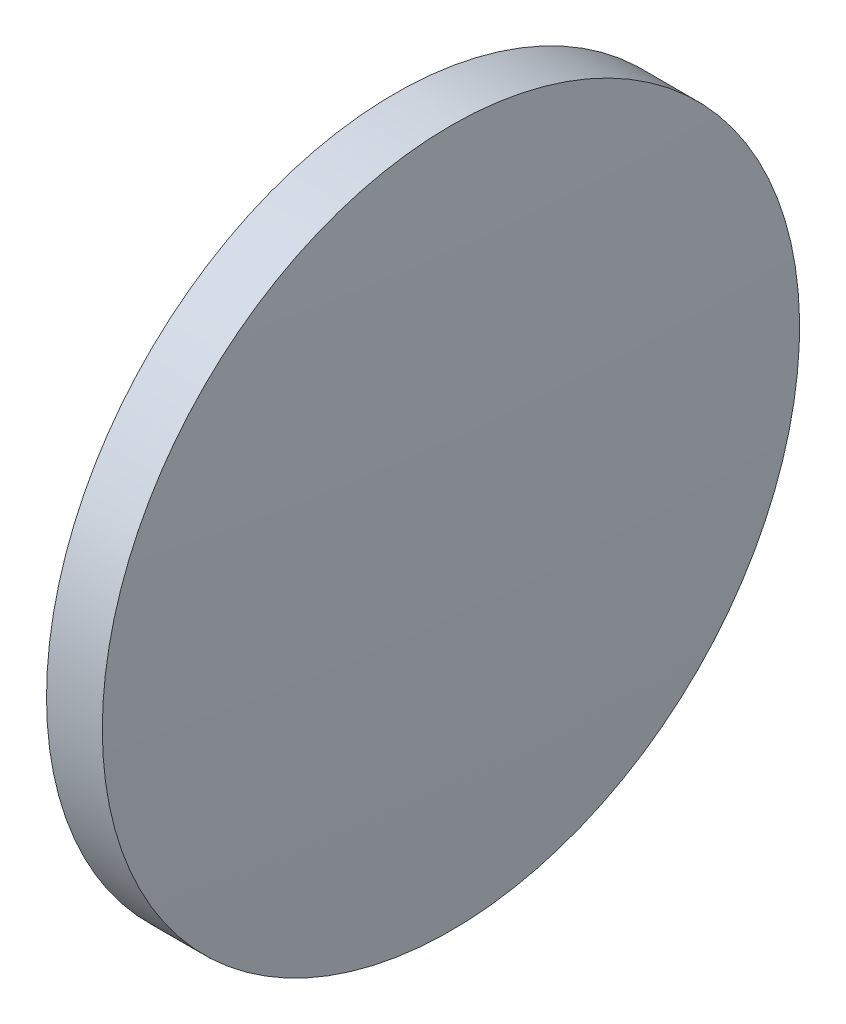
ISO-10303-21;
HEADER;
FILE_DESCRIPTION(('STEP AP214'),'2;1');
FILE_NAME('part.step','',(''),(''),'','','');
FILE_SCHEMA(('AUTOMOTIVE_DESIGN { 1 0 10303 214 1 1 1 1 }'));
ENDSEC;
DATA;
#1=APPLICATION_CONTEXT('core data for automotive mechanical design processes');
#2=APPLICATION_PROTOCOL_DEFINITION('international standard','automotive_design',2000,#1);
#3=PRODUCT_CONTEXT('',#1,'mechanical');
#4=PRODUCT('Part','Part','',(#3));
#5=PRODUCT_RELATED_PRODUCT_CATEGORY('part','',(#4));
#6=PRODUCT_DEFINITION_FORMATION('','',#4);
#7=PRODUCT_DEFINITION_CONTEXT('part definition',#1,'design');
#8=PRODUCT_DEFINITION('design','',#6,#7);
#9=PRODUCT_DEFINITION_SHAPE('','',#8);
#10=(LENGTH_UNIT() NAMED_UNIT(*) SI_UNIT(.MILLI.,.METRE.));
#11=(NAMED_UNIT(*) PLANE_ANGLE_UNIT() SI_UNIT($,.RADIAN.));
#12=(NAMED_UNIT(*) SI_UNIT($,.STERADIAN.) SOLID_ANGLE_UNIT());
#13=UNCERTAINTY_MEASURE_WITH_UNIT(LENGTH_MEASURE(1.E-05),#10,'distance_accuracy_value','');
#14=(GEOMETRIC_REPRESENTATION_CONTEXT(3) GLOBAL_UNCERTAINTY_ASSIGNED_CONTEXT((#13)) GLOBAL_UNIT_ASSIGNED_CONTEXT((#10,
#11,#12)) REPRESENTATION_CONTEXT('',''));
#15=CARTESIAN_POINT('',(0.,0.,0.));
#16=DIRECTION('',(0.,0.,1.));
#17=DIRECTION('',(1.,0.,0.));
#18=AXIS2_PLACEMENT_3D('',#15,#16,#17);
#19=CARTESIAN_POINT('',(490.791781865808,53.9419902168556,0.));
#20=DIRECTION('',(-1.,0.,0.));
#21=DIRECTION('',(0.,1.,0.));
#22=AXIS2_PLACEMENT_3D('',#19,#20,#21);
#23=SPHERICAL_SURFACE('',#22,205.782105263158);
#24=CARTESIAN_POINT('',(696.193887128966,53.9419902168559,0.));
#25=DIRECTION('',(-1.,0.,0.));
#26=DIRECTION('',(0.,0.,1.));
#27=AXIS2_PLACEMENT_3D('',#24,#25,#26);
#28=CIRCLE('',#27,12.5);
#29=CARTESIAN_POINT('',(696.193887128966,53.9419902168559,12.5));
#30=VERTEX_POINT('',#29);
#31=EDGE_CURVE('E10',#30,#30,#28,.T.);
#32=ORIENTED_EDGE('',*,*,#31,.F.);
#33=EDGE_LOOP('',(#32));
#34=FACE_BOUND('',#33,.T.);
#35=ADVANCED_FACE('F35',(#34),#23,.T.);
#36=CARTESIAN_POINT('',(692.164779550529,53.9419902168559,0.));
#37=DIRECTION('',(-1.,0.,0.));
#38=DIRECTION('',(0.,0.,1.));
#39=AXIS2_PLACEMENT_3D('',#36,#37,#38);
#40=CYLINDRICAL_SURFACE('',#39,12.5);
#41=CARTESIAN_POINT('',(694.193887128966,53.9419902168559,0.));
#42=DIRECTION('',(-1.,0.,0.));
#43=DIRECTION('',(0.,0.,1.));
#44=AXIS2_PLACEMENT_3D('',#41,#42,#43);
#45=CIRCLE('',#44,12.5);
#46=CARTESIAN_POINT('',(694.193887128966,53.9419902168559,12.5));
#47=VERTEX_POINT('',#46);
#48=EDGE_CURVE('E41',#47,#47,#45,.T.);
#49=ORIENTED_EDGE('',*,*,#48,.F.);
#50=EDGE_LOOP('',(#49));
#51=FACE_BOUND('',#50,.T.);
#52=ORIENTED_EDGE('',*,*,#31,.T.);
#53=EDGE_LOOP('',(#52));
#54=FACE_BOUND('',#53,.T.);
#55=ADVANCED_FACE('F49',(#51,#54),#40,.T.);
#56=CARTESIAN_POINT('',(694.193887128966,53.9419902168559,0.));
#57=DIRECTION('',(1.,0.,0.));
#58=DIRECTION('',(0.,0.,-1.));
#59=AXIS2_PLACEMENT_3D('',#56,#57,#58);
#60=PLANE('',#59);
#61=ORIENTED_EDGE('',*,*,#48,.T.);
#62=EDGE_LOOP('',(#61));
#63=FACE_BOUND('',#62,.T.);
#64=ADVANCED_FACE('F47',(#63),#60,.F.);
#65=CLOSED_SHELL('',(#35,#55,#64));
#66=MANIFOLD_SOLID_BREP('B2',#65);
#67=ADVANCED_BREP_SHAPE_REPRESENTATION('',(#18,#66),#14);
#68=SHAPE_DEFINITION_REPRESENTATION(#9,#67);
ENDSEC;
END-ISO-10303-21;
